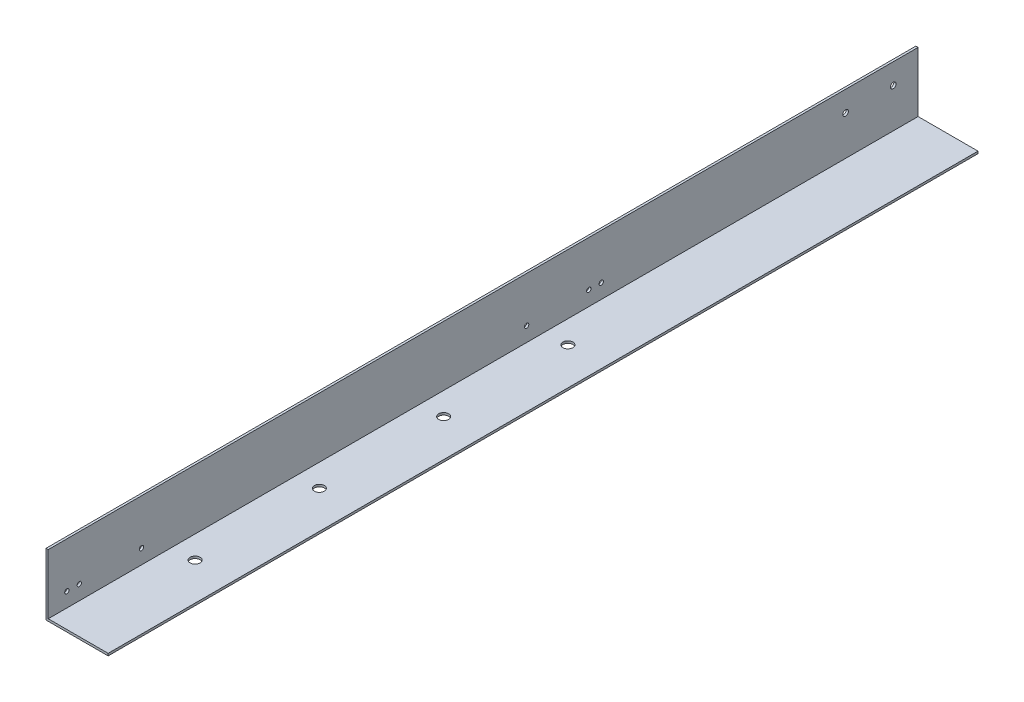
ISO-10303-21;
HEADER;
FILE_DESCRIPTION(('STEP AP214'),'2;1');
FILE_NAME('part.step','',(''),(''),'','','');
FILE_SCHEMA(('AUTOMOTIVE_DESIGN { 1 0 10303 214 1 1 1 1 }'));
ENDSEC;
DATA;
#1=APPLICATION_CONTEXT('core data for automotive mechanical design processes');
#2=APPLICATION_PROTOCOL_DEFINITION('international standard','automotive_design',2000,#1);
#3=PRODUCT_CONTEXT('',#1,'mechanical');
#4=PRODUCT('Part','Part','',(#3));
#5=PRODUCT_RELATED_PRODUCT_CATEGORY('part','',(#4));
#6=PRODUCT_DEFINITION_FORMATION('','',#4);
#7=PRODUCT_DEFINITION_CONTEXT('part definition',#1,'design');
#8=PRODUCT_DEFINITION('design','',#6,#7);
#9=PRODUCT_DEFINITION_SHAPE('','',#8);
#10=(LENGTH_UNIT() NAMED_UNIT(*) SI_UNIT(.MILLI.,.METRE.));
#11=(NAMED_UNIT(*) PLANE_ANGLE_UNIT() SI_UNIT($,.RADIAN.));
#12=(NAMED_UNIT(*) SI_UNIT($,.STERADIAN.) SOLID_ANGLE_UNIT());
#13=UNCERTAINTY_MEASURE_WITH_UNIT(LENGTH_MEASURE(1.E-05),#10,'distance_accuracy_value','');
#14=(GEOMETRIC_REPRESENTATION_CONTEXT(3) GLOBAL_UNCERTAINTY_ASSIGNED_CONTEXT((#13)) GLOBAL_UNIT_ASSIGNED_CONTEXT((#10,
#11,#12)) REPRESENTATION_CONTEXT('',''));
#15=CARTESIAN_POINT('',(0.,0.,0.));
#16=DIRECTION('',(0.,0.,1.));
#17=DIRECTION('',(1.,0.,0.));
#18=AXIS2_PLACEMENT_3D('',#15,#16,#17);
#19=CARTESIAN_POINT('',(0.,50.,700.));
#20=DIRECTION('',(0.,1.,0.));
#21=DIRECTION('',(-1.,0.,0.));
#22=AXIS2_PLACEMENT_3D('',#19,#20,#21);
#23=PLANE('',#22);
#24=DIRECTION('',(1.,0.,0.));
#25=VECTOR('',#24,1.);
#26=CARTESIAN_POINT('',(0.,50.,0.));
#27=LINE('',#26,#25);
#28=CARTESIAN_POINT('',(0.,50.,0.));
#29=VERTEX_POINT('',#28);
#30=CARTESIAN_POINT('',(1.8,50.,0.));
#31=VERTEX_POINT('',#30);
#32=EDGE_CURVE('E123',#29,#31,#27,.T.);
#33=ORIENTED_EDGE('',*,*,#32,.F.);
#34=DIRECTION('',(0.,0.,-1.));
#35=VECTOR('',#34,1.);
#36=CARTESIAN_POINT('',(0.,50.,700.));
#37=LINE('',#36,#35);
#38=CARTESIAN_POINT('',(0.,50.,700.));
#39=VERTEX_POINT('',#38);
#40=EDGE_CURVE('E11',#39,#29,#37,.T.);
#41=ORIENTED_EDGE('',*,*,#40,.F.);
#42=DIRECTION('',(1.,0.,0.));
#43=VECTOR('',#42,1.);
#44=CARTESIAN_POINT('',(0.,50.,700.));
#45=LINE('',#44,#43);
#46=CARTESIAN_POINT('',(1.8,50.,700.));
#47=VERTEX_POINT('',#46);
#48=EDGE_CURVE('E136',#39,#47,#45,.T.);
#49=ORIENTED_EDGE('',*,*,#48,.T.);
#50=DIRECTION('',(0.,0.,-1.));
#51=VECTOR('',#50,1.);
#52=CARTESIAN_POINT('',(1.8,50.,700.));
#53=LINE('',#52,#51);
#54=EDGE_CURVE('E83',#47,#31,#53,.T.);
#55=ORIENTED_EDGE('',*,*,#54,.T.);
#56=EDGE_LOOP('',(#33,#41,#49,#55));
#57=FACE_BOUND('',#56,.T.);
#58=ADVANCED_FACE('F35',(#57),#23,.T.);
#59=CARTESIAN_POINT('',(0.,50.,700.));
#60=DIRECTION('',(1.,0.,0.));
#61=DIRECTION('',(0.,1.,0.));
#62=AXIS2_PLACEMENT_3D('',#59,#60,#61);
#63=PLANE('',#62);
#64=CARTESIAN_POINT('',(0.,13.5,685.));
#65=DIRECTION('',(-1.,0.,0.));
#66=DIRECTION('',(0.,0.,1.));
#67=AXIS2_PLACEMENT_3D('',#64,#65,#66);
#68=CIRCLE('',#67,1.74999999999999);
#69=CARTESIAN_POINT('',(0.,13.5,686.75));
#70=VERTEX_POINT('',#69);
#71=EDGE_CURVE('E268',#70,#70,#68,.T.);
#72=ORIENTED_EDGE('',*,*,#71,.F.);
#73=EDGE_LOOP('',(#72));
#74=FACE_BOUND('',#73,.T.);
#75=CARTESIAN_POINT('',(0.,13.5,675.));
#76=DIRECTION('',(-1.,0.,0.));
#77=DIRECTION('',(0.,0.,1.));
#78=AXIS2_PLACEMENT_3D('',#75,#76,#77);
#79=CIRCLE('',#78,1.74999999999999);
#80=CARTESIAN_POINT('',(0.,13.5,676.75));
#81=VERTEX_POINT('',#80);
#82=EDGE_CURVE('E270',#81,#81,#79,.T.);
#83=ORIENTED_EDGE('',*,*,#82,.F.);
#84=EDGE_LOOP('',(#83));
#85=FACE_BOUND('',#84,.T.);
#86=CARTESIAN_POINT('',(0.,13.5,625.));
#87=DIRECTION('',(-1.,0.,0.));
#88=DIRECTION('',(0.,0.,1.));
#89=AXIS2_PLACEMENT_3D('',#86,#87,#88);
#90=CIRCLE('',#89,1.74999999999999);
#91=CARTESIAN_POINT('',(0.,13.5,626.75));
#92=VERTEX_POINT('',#91);
#93=EDGE_CURVE('E278',#92,#92,#90,.T.);
#94=ORIENTED_EDGE('',*,*,#93,.F.);
#95=EDGE_LOOP('',(#94));
#96=FACE_BOUND('',#95,.T.);
#97=CARTESIAN_POINT('',(0.,13.4999999999999,255.));
#98=DIRECTION('',(-1.,0.,0.));
#99=DIRECTION('',(0.,0.,1.));
#100=AXIS2_PLACEMENT_3D('',#97,#98,#99);
#101=CIRCLE('',#100,1.74999999999999);
#102=CARTESIAN_POINT('',(0.,13.4999999999999,256.75));
#103=VERTEX_POINT('',#102);
#104=EDGE_CURVE('E284',#103,#103,#101,.T.);
#105=ORIENTED_EDGE('',*,*,#104,.F.);
#106=EDGE_LOOP('',(#105));
#107=FACE_BOUND('',#106,.T.);
#108=CARTESIAN_POINT('',(0.,13.4999999999999,265.));
#109=DIRECTION('',(-1.,0.,0.));
#110=DIRECTION('',(0.,0.,1.));
#111=AXIS2_PLACEMENT_3D('',#108,#109,#110);
#112=CIRCLE('',#111,1.74999999999999);
#113=CARTESIAN_POINT('',(0.,13.4999999999999,266.75));
#114=VERTEX_POINT('',#113);
#115=EDGE_CURVE('E290',#114,#114,#112,.T.);
#116=ORIENTED_EDGE('',*,*,#115,.F.);
#117=EDGE_LOOP('',(#116));
#118=FACE_BOUND('',#117,.T.);
#119=CARTESIAN_POINT('',(0.,13.5,315.));
#120=DIRECTION('',(-1.,0.,0.));
#121=DIRECTION('',(0.,0.,1.));
#122=AXIS2_PLACEMENT_3D('',#119,#120,#121);
#123=CIRCLE('',#122,1.74999999999999);
#124=CARTESIAN_POINT('',(0.,13.5,316.75));
#125=VERTEX_POINT('',#124);
#126=EDGE_CURVE('E296',#125,#125,#123,.T.);
#127=ORIENTED_EDGE('',*,*,#126,.F.);
#128=EDGE_LOOP('',(#127));
#129=FACE_BOUND('',#128,.T.);
#130=CARTESIAN_POINT('',(0.,33.4999999999999,20.));
#131=DIRECTION('',(-1.,0.,0.));
#132=DIRECTION('',(0.,-1.,0.));
#133=AXIS2_PLACEMENT_3D('',#130,#131,#132);
#134=CIRCLE('',#133,2.25);
#135=CARTESIAN_POINT('',(0.,31.2499999999999,20.));
#136=VERTEX_POINT('',#135);
#137=EDGE_CURVE('E169',#136,#136,#134,.T.);
#138=ORIENTED_EDGE('',*,*,#137,.F.);
#139=EDGE_LOOP('',(#138));
#140=FACE_BOUND('',#139,.T.);
#141=CARTESIAN_POINT('',(0.,33.4999999999999,58.34));
#142=DIRECTION('',(-1.,0.,0.));
#143=DIRECTION('',(0.,-1.,0.));
#144=AXIS2_PLACEMENT_3D('',#141,#142,#143);
#145=CIRCLE('',#144,2.25);
#146=CARTESIAN_POINT('',(0.,31.2499999999999,58.34));
#147=VERTEX_POINT('',#146);
#148=EDGE_CURVE('E159',#147,#147,#145,.T.);
#149=ORIENTED_EDGE('',*,*,#148,.F.);
#150=EDGE_LOOP('',(#149));
#151=FACE_BOUND('',#150,.T.);
#152=DIRECTION('',(0.,-1.,0.));
#153=VECTOR('',#152,1.);
#154=CARTESIAN_POINT('',(0.,50.,0.));
#155=LINE('',#154,#153);
#156=CARTESIAN_POINT('',(0.,0.,0.));
#157=VERTEX_POINT('',#156);
#158=EDGE_CURVE('E74',#29,#157,#155,.T.);
#159=ORIENTED_EDGE('',*,*,#158,.T.);
#160=DIRECTION('',(0.,0.,-1.));
#161=VECTOR('',#160,1.);
#162=CARTESIAN_POINT('',(0.,0.,700.));
#163=LINE('',#162,#161);
#164=CARTESIAN_POINT('',(0.,0.,700.));
#165=VERTEX_POINT('',#164);
#166=EDGE_CURVE('E44',#165,#157,#163,.T.);
#167=ORIENTED_EDGE('',*,*,#166,.F.);
#168=DIRECTION('',(0.,-1.,0.));
#169=VECTOR('',#168,1.);
#170=CARTESIAN_POINT('',(0.,50.,700.));
#171=LINE('',#170,#169);
#172=EDGE_CURVE('E102',#39,#165,#171,.T.);
#173=ORIENTED_EDGE('',*,*,#172,.F.);
#174=ORIENTED_EDGE('',*,*,#40,.T.);
#175=EDGE_LOOP('',(#159,#167,#173,#174));
#176=FACE_BOUND('',#175,.T.);
#177=ADVANCED_FACE('F197',(#74,#85,#96,#107,#118,#129,#140,#151,#176),#63,.F.);
#178=CARTESIAN_POINT('',(0.,0.,700.));
#179=DIRECTION('',(0.,1.,0.));
#180=DIRECTION('',(0.,0.,1.));
#181=AXIS2_PLACEMENT_3D('',#178,#179,#180);
#182=PLANE('',#181);
#183=CARTESIAN_POINT('',(20.,0.,400.));
#184=DIRECTION('',(0.,-1.,0.));
#185=DIRECTION('',(0.,0.,-1.));
#186=AXIS2_PLACEMENT_3D('',#183,#184,#185);
#187=CIRCLE('',#186,4.);
#188=CARTESIAN_POINT('',(20.,0.,396.));
#189=VERTEX_POINT('',#188);
#190=EDGE_CURVE('E156',#189,#189,#187,.T.);
#191=ORIENTED_EDGE('',*,*,#190,.F.);
#192=EDGE_LOOP('',(#191));
#193=FACE_BOUND('',#192,.T.);
#194=CARTESIAN_POINT('',(20.,0.,600.));
#195=DIRECTION('',(0.,-1.,0.));
#196=DIRECTION('',(0.,0.,-1.));
#197=AXIS2_PLACEMENT_3D('',#194,#195,#196);
#198=CIRCLE('',#197,4.);
#199=CARTESIAN_POINT('',(20.,0.,596.));
#200=VERTEX_POINT('',#199);
#201=EDGE_CURVE('E153',#200,#200,#198,.T.);
#202=ORIENTED_EDGE('',*,*,#201,.F.);
#203=EDGE_LOOP('',(#202));
#204=FACE_BOUND('',#203,.T.);
#205=CARTESIAN_POINT('',(20.,0.,500.));
#206=DIRECTION('',(0.,-1.,0.));
#207=DIRECTION('',(0.,0.,-1.));
#208=AXIS2_PLACEMENT_3D('',#205,#206,#207);
#209=CIRCLE('',#208,4.);
#210=CARTESIAN_POINT('',(20.,0.,496.));
#211=VERTEX_POINT('',#210);
#212=EDGE_CURVE('E149',#211,#211,#209,.T.);
#213=ORIENTED_EDGE('',*,*,#212,.F.);
#214=EDGE_LOOP('',(#213));
#215=FACE_BOUND('',#214,.T.);
#216=CARTESIAN_POINT('',(20.,0.,300.));
#217=DIRECTION('',(0.,-1.,0.));
#218=DIRECTION('',(0.,0.,-1.));
#219=AXIS2_PLACEMENT_3D('',#216,#217,#218);
#220=CIRCLE('',#219,4.);
#221=CARTESIAN_POINT('',(20.,0.,296.));
#222=VERTEX_POINT('',#221);
#223=EDGE_CURVE('E145',#222,#222,#220,.T.);
#224=ORIENTED_EDGE('',*,*,#223,.F.);
#225=EDGE_LOOP('',(#224));
#226=FACE_BOUND('',#225,.T.);
#227=DIRECTION('',(1.,0.,0.));
#228=VECTOR('',#227,1.);
#229=CARTESIAN_POINT('',(0.,0.,0.));
#230=LINE('',#229,#228);
#231=CARTESIAN_POINT('',(50.,0.,0.));
#232=VERTEX_POINT('',#231);
#233=EDGE_CURVE('E109',#157,#232,#230,.T.);
#234=ORIENTED_EDGE('',*,*,#233,.T.);
#235=DIRECTION('',(0.,0.,-1.));
#236=VECTOR('',#235,1.);
#237=CARTESIAN_POINT('',(50.,0.,700.));
#238=LINE('',#237,#236);
#239=CARTESIAN_POINT('',(50.,0.,700.));
#240=VERTEX_POINT('',#239);
#241=EDGE_CURVE('E106',#240,#232,#238,.T.);
#242=ORIENTED_EDGE('',*,*,#241,.F.);
#243=DIRECTION('',(1.,0.,0.));
#244=VECTOR('',#243,1.);
#245=CARTESIAN_POINT('',(0.,0.,700.));
#246=LINE('',#245,#244);
#247=EDGE_CURVE('E94',#165,#240,#246,.T.);
#248=ORIENTED_EDGE('',*,*,#247,.F.);
#249=ORIENTED_EDGE('',*,*,#166,.T.);
#250=EDGE_LOOP('',(#234,#242,#248,#249));
#251=FACE_BOUND('',#250,.T.);
#252=ADVANCED_FACE('F107',(#193,#204,#215,#226,#251),#182,.F.);
#253=CARTESIAN_POINT('',(50.,1.8,700.));
#254=DIRECTION('',(1.,0.,0.));
#255=DIRECTION('',(0.,0.,-1.));
#256=AXIS2_PLACEMENT_3D('',#253,#254,#255);
#257=PLANE('',#256);
#258=DIRECTION('',(0.,-1.,0.));
#259=VECTOR('',#258,1.);
#260=CARTESIAN_POINT('',(50.,1.8,0.));
#261=LINE('',#260,#259);
#262=CARTESIAN_POINT('',(50.,1.8,0.));
#263=VERTEX_POINT('',#262);
#264=EDGE_CURVE('E133',#263,#232,#261,.T.);
#265=ORIENTED_EDGE('',*,*,#264,.F.);
#266=DIRECTION('',(0.,0.,-1.));
#267=VECTOR('',#266,1.);
#268=CARTESIAN_POINT('',(50.,1.8,700.));
#269=LINE('',#268,#267);
#270=CARTESIAN_POINT('',(50.,1.8,700.));
#271=VERTEX_POINT('',#270);
#272=EDGE_CURVE('E113',#271,#263,#269,.T.);
#273=ORIENTED_EDGE('',*,*,#272,.F.);
#274=DIRECTION('',(0.,-1.,0.));
#275=VECTOR('',#274,1.);
#276=CARTESIAN_POINT('',(50.,1.8,700.));
#277=LINE('',#276,#275);
#278=EDGE_CURVE('E100',#271,#240,#277,.T.);
#279=ORIENTED_EDGE('',*,*,#278,.T.);
#280=ORIENTED_EDGE('',*,*,#241,.T.);
#281=EDGE_LOOP('',(#265,#273,#279,#280));
#282=FACE_BOUND('',#281,.T.);
#283=ADVANCED_FACE('F115',(#282),#257,.T.);
#284=CARTESIAN_POINT('',(1.80000000000001,1.8,700.));
#285=DIRECTION('',(0.,1.,0.));
#286=DIRECTION('',(0.,0.,1.));
#287=AXIS2_PLACEMENT_3D('',#284,#285,#286);
#288=PLANE('',#287);
#289=CARTESIAN_POINT('',(20.,1.8,400.));
#290=DIRECTION('',(0.,1.,0.));
#291=DIRECTION('',(0.,0.,1.));
#292=AXIS2_PLACEMENT_3D('',#289,#290,#291);
#293=CIRCLE('',#292,4.);
#294=CARTESIAN_POINT('',(20.,1.8,404.));
#295=VERTEX_POINT('',#294);
#296=EDGE_CURVE('E154',#295,#295,#293,.T.);
#297=ORIENTED_EDGE('',*,*,#296,.F.);
#298=EDGE_LOOP('',(#297));
#299=FACE_BOUND('',#298,.T.);
#300=CARTESIAN_POINT('',(20.,1.8,600.));
#301=DIRECTION('',(0.,1.,0.));
#302=DIRECTION('',(0.,0.,1.));
#303=AXIS2_PLACEMENT_3D('',#300,#301,#302);
#304=CIRCLE('',#303,4.);
#305=CARTESIAN_POINT('',(20.,1.8,604.));
#306=VERTEX_POINT('',#305);
#307=EDGE_CURVE('E150',#306,#306,#304,.T.);
#308=ORIENTED_EDGE('',*,*,#307,.F.);
#309=EDGE_LOOP('',(#308));
#310=FACE_BOUND('',#309,.T.);
#311=CARTESIAN_POINT('',(20.,1.8,500.));
#312=DIRECTION('',(0.,1.,0.));
#313=DIRECTION('',(0.,0.,1.));
#314=AXIS2_PLACEMENT_3D('',#311,#312,#313);
#315=CIRCLE('',#314,4.);
#316=CARTESIAN_POINT('',(20.,1.8,504.));
#317=VERTEX_POINT('',#316);
#318=EDGE_CURVE('E146',#317,#317,#315,.T.);
#319=ORIENTED_EDGE('',*,*,#318,.F.);
#320=EDGE_LOOP('',(#319));
#321=FACE_BOUND('',#320,.T.);
#322=CARTESIAN_POINT('',(20.,1.8,300.));
#323=DIRECTION('',(0.,1.,0.));
#324=DIRECTION('',(0.,0.,1.));
#325=AXIS2_PLACEMENT_3D('',#322,#323,#324);
#326=CIRCLE('',#325,4.);
#327=CARTESIAN_POINT('',(20.,1.8,304.));
#328=VERTEX_POINT('',#327);
#329=EDGE_CURVE('E127',#328,#328,#326,.T.);
#330=ORIENTED_EDGE('',*,*,#329,.F.);
#331=EDGE_LOOP('',(#330));
#332=FACE_BOUND('',#331,.T.);
#333=DIRECTION('',(1.,0.,0.));
#334=VECTOR('',#333,1.);
#335=CARTESIAN_POINT('',(1.80000000000001,1.8,0.));
#336=LINE('',#335,#334);
#337=CARTESIAN_POINT('',(1.80000000000001,1.8,0.));
#338=VERTEX_POINT('',#337);
#339=EDGE_CURVE('E130',#338,#263,#336,.T.);
#340=ORIENTED_EDGE('',*,*,#339,.F.);
#341=DIRECTION('',(0.,0.,-1.));
#342=VECTOR('',#341,1.);
#343=CARTESIAN_POINT('',(1.80000000000001,1.8,700.));
#344=LINE('',#343,#342);
#345=CARTESIAN_POINT('',(1.80000000000001,1.8,700.));
#346=VERTEX_POINT('',#345);
#347=EDGE_CURVE('E140',#346,#338,#344,.T.);
#348=ORIENTED_EDGE('',*,*,#347,.F.);
#349=DIRECTION('',(1.,0.,0.));
#350=VECTOR('',#349,1.);
#351=CARTESIAN_POINT('',(1.80000000000001,1.8,700.));
#352=LINE('',#351,#350);
#353=EDGE_CURVE('E116',#346,#271,#352,.T.);
#354=ORIENTED_EDGE('',*,*,#353,.T.);
#355=ORIENTED_EDGE('',*,*,#272,.T.);
#356=EDGE_LOOP('',(#340,#348,#354,#355));
#357=FACE_BOUND('',#356,.T.);
#358=ADVANCED_FACE('F184',(#299,#310,#321,#332,#357),#288,.T.);
#359=CARTESIAN_POINT('',(1.8,50.,700.));
#360=DIRECTION('',(1.,0.,0.));
#361=DIRECTION('',(0.,1.,0.));
#362=AXIS2_PLACEMENT_3D('',#359,#360,#361);
#363=PLANE('',#362);
#364=CARTESIAN_POINT('',(1.80000000000001,13.5,685.));
#365=DIRECTION('',(1.,0.,0.));
#366=DIRECTION('',(0.,1.,0.));
#367=AXIS2_PLACEMENT_3D('',#364,#365,#366);
#368=CIRCLE('',#367,1.74999999999999);
#369=CARTESIAN_POINT('',(1.80000000000001,15.25,685.));
#370=VERTEX_POINT('',#369);
#371=EDGE_CURVE('E266',#370,#370,#368,.T.);
#372=ORIENTED_EDGE('',*,*,#371,.F.);
#373=EDGE_LOOP('',(#372));
#374=FACE_BOUND('',#373,.T.);
#375=CARTESIAN_POINT('',(1.80000000000001,13.5,675.));
#376=DIRECTION('',(1.,0.,0.));
#377=DIRECTION('',(0.,1.,0.));
#378=AXIS2_PLACEMENT_3D('',#375,#376,#377);
#379=CIRCLE('',#378,1.74999999999999);
#380=CARTESIAN_POINT('',(1.80000000000001,15.25,675.));
#381=VERTEX_POINT('',#380);
#382=EDGE_CURVE('E275',#381,#381,#379,.T.);
#383=ORIENTED_EDGE('',*,*,#382,.F.);
#384=EDGE_LOOP('',(#383));
#385=FACE_BOUND('',#384,.T.);
#386=CARTESIAN_POINT('',(1.80000000000001,13.5,625.));
#387=DIRECTION('',(1.,0.,0.));
#388=DIRECTION('',(0.,1.,0.));
#389=AXIS2_PLACEMENT_3D('',#386,#387,#388);
#390=CIRCLE('',#389,1.74999999999999);
#391=CARTESIAN_POINT('',(1.80000000000001,15.25,625.));
#392=VERTEX_POINT('',#391);
#393=EDGE_CURVE('E281',#392,#392,#390,.T.);
#394=ORIENTED_EDGE('',*,*,#393,.F.);
#395=EDGE_LOOP('',(#394));
#396=FACE_BOUND('',#395,.T.);
#397=CARTESIAN_POINT('',(1.80000000000001,13.4999999999999,255.));
#398=DIRECTION('',(1.,0.,0.));
#399=DIRECTION('',(0.,1.,0.));
#400=AXIS2_PLACEMENT_3D('',#397,#398,#399);
#401=CIRCLE('',#400,1.74999999999999);
#402=CARTESIAN_POINT('',(1.80000000000001,15.2499999999999,255.));
#403=VERTEX_POINT('',#402);
#404=EDGE_CURVE('E287',#403,#403,#401,.T.);
#405=ORIENTED_EDGE('',*,*,#404,.F.);
#406=EDGE_LOOP('',(#405));
#407=FACE_BOUND('',#406,.T.);
#408=CARTESIAN_POINT('',(1.80000000000001,13.4999999999999,265.));
#409=DIRECTION('',(1.,0.,0.));
#410=DIRECTION('',(0.,1.,0.));
#411=AXIS2_PLACEMENT_3D('',#408,#409,#410);
#412=CIRCLE('',#411,1.74999999999999);
#413=CARTESIAN_POINT('',(1.80000000000001,15.2499999999999,265.));
#414=VERTEX_POINT('',#413);
#415=EDGE_CURVE('E293',#414,#414,#412,.T.);
#416=ORIENTED_EDGE('',*,*,#415,.F.);
#417=EDGE_LOOP('',(#416));
#418=FACE_BOUND('',#417,.T.);
#419=CARTESIAN_POINT('',(1.80000000000001,13.5,315.));
#420=DIRECTION('',(1.,0.,0.));
#421=DIRECTION('',(0.,1.,0.));
#422=AXIS2_PLACEMENT_3D('',#419,#420,#421);
#423=CIRCLE('',#422,1.74999999999999);
#424=CARTESIAN_POINT('',(1.80000000000001,15.2499999999999,315.));
#425=VERTEX_POINT('',#424);
#426=EDGE_CURVE('E298',#425,#425,#423,.T.);
#427=ORIENTED_EDGE('',*,*,#426,.F.);
#428=EDGE_LOOP('',(#427));
#429=FACE_BOUND('',#428,.T.);
#430=CARTESIAN_POINT('',(1.8,33.4999999999999,20.));
#431=DIRECTION('',(1.,0.,0.));
#432=DIRECTION('',(0.,1.,0.));
#433=AXIS2_PLACEMENT_3D('',#430,#431,#432);
#434=CIRCLE('',#433,2.25);
#435=CARTESIAN_POINT('',(1.8,35.7499999999999,20.));
#436=VERTEX_POINT('',#435);
#437=EDGE_CURVE('E38',#436,#436,#434,.T.);
#438=ORIENTED_EDGE('',*,*,#437,.F.);
#439=EDGE_LOOP('',(#438));
#440=FACE_BOUND('',#439,.T.);
#441=CARTESIAN_POINT('',(1.8,33.4999999999999,58.34));
#442=DIRECTION('',(1.,0.,0.));
#443=DIRECTION('',(0.,1.,0.));
#444=AXIS2_PLACEMENT_3D('',#441,#442,#443);
#445=CIRCLE('',#444,2.25);
#446=CARTESIAN_POINT('',(1.8,35.7499999999999,58.34));
#447=VERTEX_POINT('',#446);
#448=EDGE_CURVE('E157',#447,#447,#445,.T.);
#449=ORIENTED_EDGE('',*,*,#448,.F.);
#450=EDGE_LOOP('',(#449));
#451=FACE_BOUND('',#450,.T.);
#452=DIRECTION('',(0.,-1.,0.));
#453=VECTOR('',#452,1.);
#454=CARTESIAN_POINT('',(1.8,50.,0.));
#455=LINE('',#454,#453);
#456=EDGE_CURVE('E126',#31,#338,#455,.T.);
#457=ORIENTED_EDGE('',*,*,#456,.F.);
#458=ORIENTED_EDGE('',*,*,#54,.F.);
#459=DIRECTION('',(0.,-1.,0.));
#460=VECTOR('',#459,1.);
#461=CARTESIAN_POINT('',(1.8,50.,700.));
#462=LINE('',#461,#460);
#463=EDGE_CURVE('E118',#47,#346,#462,.T.);
#464=ORIENTED_EDGE('',*,*,#463,.T.);
#465=ORIENTED_EDGE('',*,*,#347,.T.);
#466=EDGE_LOOP('',(#457,#458,#464,#465));
#467=FACE_BOUND('',#466,.T.);
#468=ADVANCED_FACE('F179',(#374,#385,#396,#407,#418,#429,#440,#451,#467),#363,.T.);
#469=CARTESIAN_POINT('',(0.,0.,700.));
#470=DIRECTION('',(0.,0.,-1.));
#471=DIRECTION('',(-1.,0.,0.));
#472=AXIS2_PLACEMENT_3D('',#469,#470,#471);
#473=PLANE('',#472);
#474=ORIENTED_EDGE('',*,*,#48,.F.);
#475=ORIENTED_EDGE('',*,*,#172,.T.);
#476=ORIENTED_EDGE('',*,*,#247,.T.);
#477=ORIENTED_EDGE('',*,*,#278,.F.);
#478=ORIENTED_EDGE('',*,*,#353,.F.);
#479=ORIENTED_EDGE('',*,*,#463,.F.);
#480=EDGE_LOOP('',(#474,#475,#476,#477,#478,#479));
#481=FACE_BOUND('',#480,.T.);
#482=ADVANCED_FACE('F97',(#481),#473,.F.);
#483=CARTESIAN_POINT('',(0.,0.,0.));
#484=DIRECTION('',(0.,0.,-1.));
#485=DIRECTION('',(-1.,0.,0.));
#486=AXIS2_PLACEMENT_3D('',#483,#484,#485);
#487=PLANE('',#486);
#488=ORIENTED_EDGE('',*,*,#32,.T.);
#489=ORIENTED_EDGE('',*,*,#456,.T.);
#490=ORIENTED_EDGE('',*,*,#339,.T.);
#491=ORIENTED_EDGE('',*,*,#264,.T.);
#492=ORIENTED_EDGE('',*,*,#233,.F.);
#493=ORIENTED_EDGE('',*,*,#158,.F.);
#494=EDGE_LOOP('',(#488,#489,#490,#491,#492,#493));
#495=FACE_BOUND('',#494,.T.);
#496=ADVANCED_FACE('F182',(#495),#487,.T.);
#497=CARTESIAN_POINT('',(20.,10.,300.));
#498=DIRECTION('',(0.,-1.,0.));
#499=DIRECTION('',(0.,0.,-1.));
#500=AXIS2_PLACEMENT_3D('',#497,#498,#499);
#501=CYLINDRICAL_SURFACE('',#500,4.);
#502=ORIENTED_EDGE('',*,*,#329,.T.);
#503=EDGE_LOOP('',(#502));
#504=FACE_BOUND('',#503,.T.);
#505=ORIENTED_EDGE('',*,*,#223,.T.);
#506=EDGE_LOOP('',(#505));
#507=FACE_BOUND('',#506,.T.);
#508=ADVANCED_FACE('F213',(#504,#507),#501,.F.);
#509=CARTESIAN_POINT('',(20.,10.,500.));
#510=DIRECTION('',(0.,-1.,0.));
#511=DIRECTION('',(0.,0.,-1.));
#512=AXIS2_PLACEMENT_3D('',#509,#510,#511);
#513=CYLINDRICAL_SURFACE('',#512,4.);
#514=ORIENTED_EDGE('',*,*,#318,.T.);
#515=EDGE_LOOP('',(#514));
#516=FACE_BOUND('',#515,.T.);
#517=ORIENTED_EDGE('',*,*,#212,.T.);
#518=EDGE_LOOP('',(#517));
#519=FACE_BOUND('',#518,.T.);
#520=ADVANCED_FACE('F218',(#516,#519),#513,.F.);
#521=CARTESIAN_POINT('',(20.,10.,600.));
#522=DIRECTION('',(0.,-1.,0.));
#523=DIRECTION('',(0.,0.,-1.));
#524=AXIS2_PLACEMENT_3D('',#521,#522,#523);
#525=CYLINDRICAL_SURFACE('',#524,4.);
#526=ORIENTED_EDGE('',*,*,#307,.T.);
#527=EDGE_LOOP('',(#526));
#528=FACE_BOUND('',#527,.T.);
#529=ORIENTED_EDGE('',*,*,#201,.T.);
#530=EDGE_LOOP('',(#529));
#531=FACE_BOUND('',#530,.T.);
#532=ADVANCED_FACE('F222',(#528,#531),#525,.F.);
#533=CARTESIAN_POINT('',(20.,10.,400.));
#534=DIRECTION('',(0.,-1.,0.));
#535=DIRECTION('',(0.,0.,-1.));
#536=AXIS2_PLACEMENT_3D('',#533,#534,#535);
#537=CYLINDRICAL_SURFACE('',#536,4.);
#538=ORIENTED_EDGE('',*,*,#296,.T.);
#539=EDGE_LOOP('',(#538));
#540=FACE_BOUND('',#539,.T.);
#541=ORIENTED_EDGE('',*,*,#190,.T.);
#542=EDGE_LOOP('',(#541));
#543=FACE_BOUND('',#542,.T.);
#544=ADVANCED_FACE('F226',(#540,#543),#537,.F.);
#545=CARTESIAN_POINT('',(50.,33.5,58.34));
#546=DIRECTION('',(-1.,0.,0.));
#547=DIRECTION('',(0.,-1.,0.));
#548=AXIS2_PLACEMENT_3D('',#545,#546,#547);
#549=CYLINDRICAL_SURFACE('',#548,2.25);
#550=ORIENTED_EDGE('',*,*,#448,.T.);
#551=EDGE_LOOP('',(#550));
#552=FACE_BOUND('',#551,.T.);
#553=ORIENTED_EDGE('',*,*,#148,.T.);
#554=EDGE_LOOP('',(#553));
#555=FACE_BOUND('',#554,.T.);
#556=ADVANCED_FACE('F230',(#552,#555),#549,.F.);
#557=CARTESIAN_POINT('',(50.,33.4999999999999,20.));
#558=DIRECTION('',(-1.,0.,0.));
#559=DIRECTION('',(0.,-1.,0.));
#560=AXIS2_PLACEMENT_3D('',#557,#558,#559);
#561=CYLINDRICAL_SURFACE('',#560,2.25);
#562=ORIENTED_EDGE('',*,*,#437,.T.);
#563=EDGE_LOOP('',(#562));
#564=FACE_BOUND('',#563,.T.);
#565=ORIENTED_EDGE('',*,*,#137,.T.);
#566=EDGE_LOOP('',(#565));
#567=FACE_BOUND('',#566,.T.);
#568=ADVANCED_FACE('F234',(#564,#567),#561,.F.);
#569=CARTESIAN_POINT('',(0.,13.5,315.));
#570=DIRECTION('',(-1.,0.,0.));
#571=DIRECTION('',(0.,0.,1.));
#572=AXIS2_PLACEMENT_3D('',#569,#570,#571);
#573=CYLINDRICAL_SURFACE('',#572,1.74999999999999);
#574=ORIENTED_EDGE('',*,*,#426,.T.);
#575=EDGE_LOOP('',(#574));
#576=FACE_BOUND('',#575,.T.);
#577=ORIENTED_EDGE('',*,*,#126,.T.);
#578=EDGE_LOOP('',(#577));
#579=FACE_BOUND('',#578,.T.);
#580=ADVANCED_FACE('F237',(#576,#579),#573,.F.);
#581=CARTESIAN_POINT('',(0.,13.4999999999999,265.));
#582=DIRECTION('',(-1.,0.,0.));
#583=DIRECTION('',(0.,0.,1.));
#584=AXIS2_PLACEMENT_3D('',#581,#582,#583);
#585=CYLINDRICAL_SURFACE('',#584,1.74999999999999);
#586=ORIENTED_EDGE('',*,*,#415,.T.);
#587=EDGE_LOOP('',(#586));
#588=FACE_BOUND('',#587,.T.);
#589=ORIENTED_EDGE('',*,*,#115,.T.);
#590=EDGE_LOOP('',(#589));
#591=FACE_BOUND('',#590,.T.);
#592=ADVANCED_FACE('F241',(#588,#591),#585,.F.);
#593=CARTESIAN_POINT('',(0.,13.4999999999999,255.));
#594=DIRECTION('',(-1.,0.,0.));
#595=DIRECTION('',(0.,0.,1.));
#596=AXIS2_PLACEMENT_3D('',#593,#594,#595);
#597=CYLINDRICAL_SURFACE('',#596,1.74999999999999);
#598=ORIENTED_EDGE('',*,*,#404,.T.);
#599=EDGE_LOOP('',(#598));
#600=FACE_BOUND('',#599,.T.);
#601=ORIENTED_EDGE('',*,*,#104,.T.);
#602=EDGE_LOOP('',(#601));
#603=FACE_BOUND('',#602,.T.);
#604=ADVANCED_FACE('F245',(#600,#603),#597,.F.);
#605=CARTESIAN_POINT('',(0.,13.5,625.));
#606=DIRECTION('',(-1.,0.,0.));
#607=DIRECTION('',(0.,0.,1.));
#608=AXIS2_PLACEMENT_3D('',#605,#606,#607);
#609=CYLINDRICAL_SURFACE('',#608,1.74999999999999);
#610=ORIENTED_EDGE('',*,*,#393,.T.);
#611=EDGE_LOOP('',(#610));
#612=FACE_BOUND('',#611,.T.);
#613=ORIENTED_EDGE('',*,*,#93,.T.);
#614=EDGE_LOOP('',(#613));
#615=FACE_BOUND('',#614,.T.);
#616=ADVANCED_FACE('F249',(#612,#615),#609,.F.);
#617=CARTESIAN_POINT('',(0.,13.5,675.));
#618=DIRECTION('',(-1.,0.,0.));
#619=DIRECTION('',(0.,0.,1.));
#620=AXIS2_PLACEMENT_3D('',#617,#618,#619);
#621=CYLINDRICAL_SURFACE('',#620,1.74999999999999);
#622=ORIENTED_EDGE('',*,*,#382,.T.);
#623=EDGE_LOOP('',(#622));
#624=FACE_BOUND('',#623,.T.);
#625=ORIENTED_EDGE('',*,*,#82,.T.);
#626=EDGE_LOOP('',(#625));
#627=FACE_BOUND('',#626,.T.);
#628=ADVANCED_FACE('F253',(#624,#627),#621,.F.);
#629=CARTESIAN_POINT('',(0.,13.5,685.));
#630=DIRECTION('',(-1.,0.,0.));
#631=DIRECTION('',(0.,0.,1.));
#632=AXIS2_PLACEMENT_3D('',#629,#630,#631);
#633=CYLINDRICAL_SURFACE('',#632,1.74999999999999);
#634=ORIENTED_EDGE('',*,*,#371,.T.);
#635=EDGE_LOOP('',(#634));
#636=FACE_BOUND('',#635,.T.);
#637=ORIENTED_EDGE('',*,*,#71,.T.);
#638=EDGE_LOOP('',(#637));
#639=FACE_BOUND('',#638,.T.);
#640=ADVANCED_FACE('F257',(#636,#639),#633,.F.);
#641=CLOSED_SHELL('',(#58,#177,#252,#283,#358,#468,#482,#496,#508,#520,#532,#544,#556,#568,#580,
#592,#604,#616,#628,#640));
#642=MANIFOLD_SOLID_BREP('B2',#641);
#643=ADVANCED_BREP_SHAPE_REPRESENTATION('',(#18,#642),#14);
#644=SHAPE_DEFINITION_REPRESENTATION(#9,#643);
ENDSEC;
END-ISO-10303-21;
